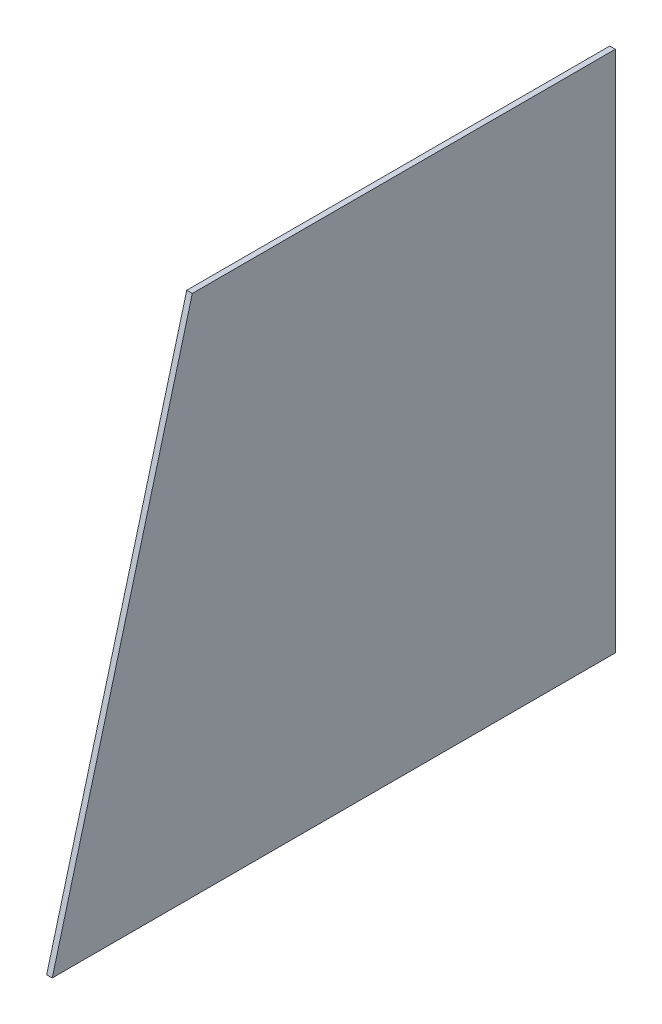
ISO-10303-21;
HEADER;
FILE_DESCRIPTION(('STEP AP214'),'2;1');
FILE_NAME('part.step','',(''),(''),'','','');
FILE_SCHEMA(('AUTOMOTIVE_DESIGN { 1 0 10303 214 1 1 1 1 }'));
ENDSEC;
DATA;
#1=APPLICATION_CONTEXT('core data for automotive mechanical design processes');
#2=APPLICATION_PROTOCOL_DEFINITION('international standard','automotive_design',2000,#1);
#3=PRODUCT_CONTEXT('',#1,'mechanical');
#4=PRODUCT('Part','Part','',(#3));
#5=PRODUCT_RELATED_PRODUCT_CATEGORY('part','',(#4));
#6=PRODUCT_DEFINITION_FORMATION('','',#4);
#7=PRODUCT_DEFINITION_CONTEXT('part definition',#1,'design');
#8=PRODUCT_DEFINITION('design','',#6,#7);
#9=PRODUCT_DEFINITION_SHAPE('','',#8);
#10=(LENGTH_UNIT() NAMED_UNIT(*) SI_UNIT(.MILLI.,.METRE.));
#11=(NAMED_UNIT(*) PLANE_ANGLE_UNIT() SI_UNIT($,.RADIAN.));
#12=(NAMED_UNIT(*) SI_UNIT($,.STERADIAN.) SOLID_ANGLE_UNIT());
#13=UNCERTAINTY_MEASURE_WITH_UNIT(LENGTH_MEASURE(1.E-05),#10,'distance_accuracy_value','');
#14=(GEOMETRIC_REPRESENTATION_CONTEXT(3) GLOBAL_UNCERTAINTY_ASSIGNED_CONTEXT((#13)) GLOBAL_UNIT_ASSIGNED_CONTEXT((#10,
#11,#12)) REPRESENTATION_CONTEXT('',''));
#15=CARTESIAN_POINT('',(0.,0.,0.));
#16=DIRECTION('',(0.,0.,1.));
#17=DIRECTION('',(1.,0.,0.));
#18=AXIS2_PLACEMENT_3D('',#15,#16,#17);
#19=CARTESIAN_POINT('',(3.,140.930435340219,-151.798793881956));
#20=DIRECTION('',(0.,0.,1.));
#21=DIRECTION('',(1.,0.,0.));
#22=AXIS2_PLACEMENT_3D('',#19,#20,#21);
#23=PLANE('',#22);
#24=DIRECTION('',(0.,1.,0.));
#25=VECTOR('',#24,1.);
#26=CARTESIAN_POINT('',(0.,140.930435340219,-151.798793881956));
#27=LINE('',#26,#25);
#28=CARTESIAN_POINT('',(0.,-140.930435340219,-151.798793881956));
#29=VERTEX_POINT('',#28);
#30=CARTESIAN_POINT('',(0.,140.930435340219,-151.798793881956));
#31=VERTEX_POINT('',#30);
#32=EDGE_CURVE('E96',#29,#31,#27,.T.);
#33=ORIENTED_EDGE('',*,*,#32,.T.);
#34=DIRECTION('',(-1.,0.,0.));
#35=VECTOR('',#34,1.);
#36=CARTESIAN_POINT('',(3.,140.930435340219,-151.798793881956));
#37=LINE('',#36,#35);
#38=CARTESIAN_POINT('',(3.,140.930435340219,-151.798793881956));
#39=VERTEX_POINT('',#38);
#40=EDGE_CURVE('E11',#39,#31,#37,.T.);
#41=ORIENTED_EDGE('',*,*,#40,.F.);
#42=DIRECTION('',(0.,1.,0.));
#43=VECTOR('',#42,1.);
#44=CARTESIAN_POINT('',(3.,140.930435340219,-151.798793881956));
#45=LINE('',#44,#43);
#46=CARTESIAN_POINT('',(3.,-140.930435340219,-151.798793881956));
#47=VERTEX_POINT('',#46);
#48=EDGE_CURVE('E84',#47,#39,#45,.T.);
#49=ORIENTED_EDGE('',*,*,#48,.F.);
#50=DIRECTION('',(-1.,0.,0.));
#51=VECTOR('',#50,1.);
#52=CARTESIAN_POINT('',(3.,-140.930435340219,-151.798793881956));
#53=LINE('',#52,#51);
#54=EDGE_CURVE('E92',#47,#29,#53,.T.);
#55=ORIENTED_EDGE('',*,*,#54,.T.);
#56=EDGE_LOOP('',(#33,#41,#49,#55));
#57=FACE_BOUND('',#56,.T.);
#58=ADVANCED_FACE('F33',(#57),#23,.F.);
#59=CARTESIAN_POINT('',(3.,140.930435340219,76.2744012051983));
#60=DIRECTION('',(0.,-1.,0.));
#61=DIRECTION('',(0.,0.,-1.));
#62=AXIS2_PLACEMENT_3D('',#59,#60,#61);
#63=PLANE('',#62);
#64=DIRECTION('',(0.,0.,1.));
#65=VECTOR('',#64,1.);
#66=CARTESIAN_POINT('',(0.,140.930435340219,76.2744012051983));
#67=LINE('',#66,#65);
#68=CARTESIAN_POINT('',(0.,140.930435340219,76.2744012051983));
#69=VERTEX_POINT('',#68);
#70=EDGE_CURVE('E88',#31,#69,#67,.T.);
#71=ORIENTED_EDGE('',*,*,#70,.T.);
#72=DIRECTION('',(-1.,0.,0.));
#73=VECTOR('',#72,1.);
#74=CARTESIAN_POINT('',(3.,140.930435340219,76.2744012051983));
#75=LINE('',#74,#73);
#76=CARTESIAN_POINT('',(3.,140.930435340219,76.2744012051983));
#77=VERTEX_POINT('',#76);
#78=EDGE_CURVE('E41',#77,#69,#75,.T.);
#79=ORIENTED_EDGE('',*,*,#78,.F.);
#80=DIRECTION('',(0.,0.,1.));
#81=VECTOR('',#80,1.);
#82=CARTESIAN_POINT('',(3.,140.930435340219,76.2744012051983));
#83=LINE('',#82,#81);
#84=EDGE_CURVE('E79',#39,#77,#83,.T.);
#85=ORIENTED_EDGE('',*,*,#84,.F.);
#86=ORIENTED_EDGE('',*,*,#40,.T.);
#87=EDGE_LOOP('',(#71,#79,#85,#86));
#88=FACE_BOUND('',#87,.T.);
#89=ADVANCED_FACE('F87',(#88),#63,.F.);
#90=CARTESIAN_POINT('',(3.,-140.930435340219,151.798793881956));
#91=DIRECTION('',(0.,-0.258819045102525,-0.965925826289067));
#92=DIRECTION('',(0.,0.965925826289067,-0.258819045102525));
#93=AXIS2_PLACEMENT_3D('',#90,#91,#92);
#94=PLANE('',#93);
#95=DIRECTION('',(0.,-0.965925826289067,0.258819045102525));
#96=VECTOR('',#95,1.);
#97=CARTESIAN_POINT('',(0.,-140.930435340219,151.798793881956));
#98=LINE('',#97,#96);
#99=CARTESIAN_POINT('',(0.,-140.930435340219,151.798793881956));
#100=VERTEX_POINT('',#99);
#101=EDGE_CURVE('E66',#69,#100,#98,.T.);
#102=ORIENTED_EDGE('',*,*,#101,.T.);
#103=DIRECTION('',(-1.,0.,0.));
#104=VECTOR('',#103,1.);
#105=CARTESIAN_POINT('',(3.,-140.930435340219,151.798793881956));
#106=LINE('',#105,#104);
#107=CARTESIAN_POINT('',(3.,-140.930435340219,151.798793881956));
#108=VERTEX_POINT('',#107);
#109=EDGE_CURVE('E89',#108,#100,#106,.T.);
#110=ORIENTED_EDGE('',*,*,#109,.F.);
#111=DIRECTION('',(0.,-0.965925826289067,0.258819045102525));
#112=VECTOR('',#111,1.);
#113=CARTESIAN_POINT('',(3.,-140.930435340219,151.798793881956));
#114=LINE('',#113,#112);
#115=EDGE_CURVE('E82',#77,#108,#114,.T.);
#116=ORIENTED_EDGE('',*,*,#115,.F.);
#117=ORIENTED_EDGE('',*,*,#78,.T.);
#118=EDGE_LOOP('',(#102,#110,#116,#117));
#119=FACE_BOUND('',#118,.T.);
#120=ADVANCED_FACE('F90',(#119),#94,.F.);
#121=CARTESIAN_POINT('',(3.,-140.930435340219,151.798793881956));
#122=DIRECTION('',(0.,1.,0.));
#123=DIRECTION('',(0.,0.,1.));
#124=AXIS2_PLACEMENT_3D('',#121,#122,#123);
#125=PLANE('',#124);
#126=DIRECTION('',(0.,0.,-1.));
#127=VECTOR('',#126,1.);
#128=CARTESIAN_POINT('',(0.,-140.930435340219,151.798793881956));
#129=LINE('',#128,#127);
#130=EDGE_CURVE('E72',#100,#29,#129,.T.);
#131=ORIENTED_EDGE('',*,*,#130,.T.);
#132=ORIENTED_EDGE('',*,*,#54,.F.);
#133=DIRECTION('',(0.,0.,-1.));
#134=VECTOR('',#133,1.);
#135=CARTESIAN_POINT('',(3.,-140.930435340219,151.798793881956));
#136=LINE('',#135,#134);
#137=EDGE_CURVE('E49',#108,#47,#136,.T.);
#138=ORIENTED_EDGE('',*,*,#137,.F.);
#139=ORIENTED_EDGE('',*,*,#109,.T.);
#140=EDGE_LOOP('',(#131,#132,#138,#139));
#141=FACE_BOUND('',#140,.T.);
#142=ADVANCED_FACE('F103',(#141),#125,.F.);
#143=CARTESIAN_POINT('',(3.,0.,0.));
#144=DIRECTION('',(1.,0.,0.));
#145=DIRECTION('',(0.,0.,-1.));
#146=AXIS2_PLACEMENT_3D('',#143,#144,#145);
#147=PLANE('',#146);
#148=ORIENTED_EDGE('',*,*,#48,.T.);
#149=ORIENTED_EDGE('',*,*,#84,.T.);
#150=ORIENTED_EDGE('',*,*,#115,.T.);
#151=ORIENTED_EDGE('',*,*,#137,.T.);
#152=EDGE_LOOP('',(#148,#149,#150,#151));
#153=FACE_BOUND('',#152,.T.);
#154=ADVANCED_FACE('F80',(#153),#147,.T.);
#155=CARTESIAN_POINT('',(0.,0.,0.));
#156=DIRECTION('',(1.,0.,0.));
#157=DIRECTION('',(0.,0.,-1.));
#158=AXIS2_PLACEMENT_3D('',#155,#156,#157);
#159=PLANE('',#158);
#160=ORIENTED_EDGE('',*,*,#32,.F.);
#161=ORIENTED_EDGE('',*,*,#130,.F.);
#162=ORIENTED_EDGE('',*,*,#101,.F.);
#163=ORIENTED_EDGE('',*,*,#70,.F.);
#164=EDGE_LOOP('',(#160,#161,#162,#163));
#165=FACE_BOUND('',#164,.T.);
#166=ADVANCED_FACE('F106',(#165),#159,.F.);
#167=CLOSED_SHELL('',(#58,#89,#120,#142,#154,#166));
#168=MANIFOLD_SOLID_BREP('B2',#167);
#169=ADVANCED_BREP_SHAPE_REPRESENTATION('',(#18,#168),#14);
#170=SHAPE_DEFINITION_REPRESENTATION(#9,#169);
ENDSEC;
END-ISO-10303-21;
